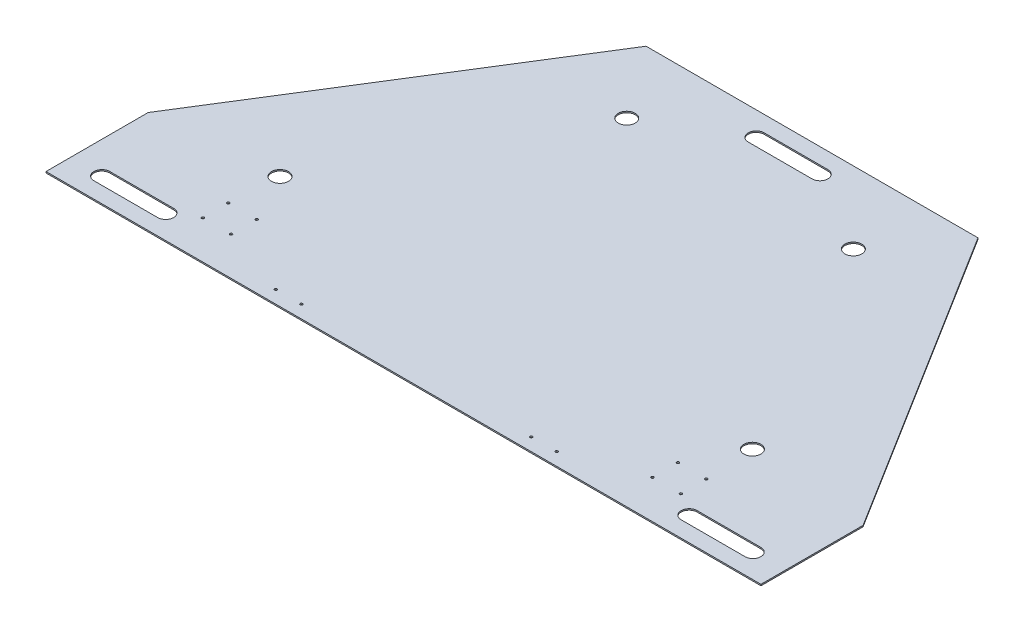
ISO-10303-21;
HEADER;
FILE_DESCRIPTION(('STEP AP214'),'2;1');
FILE_NAME('part.step','',(''),(''),'','','');
FILE_SCHEMA(('AUTOMOTIVE_DESIGN { 1 0 10303 214 1 1 1 1 }'));
ENDSEC;
DATA;
#1=APPLICATION_CONTEXT('core data for automotive mechanical design processes');
#2=APPLICATION_PROTOCOL_DEFINITION('international standard','automotive_design',2000,#1);
#3=PRODUCT_CONTEXT('',#1,'mechanical');
#4=PRODUCT('Part','Part','',(#3));
#5=PRODUCT_RELATED_PRODUCT_CATEGORY('part','',(#4));
#6=PRODUCT_DEFINITION_FORMATION('','',#4);
#7=PRODUCT_DEFINITION_CONTEXT('part definition',#1,'design');
#8=PRODUCT_DEFINITION('design','',#6,#7);
#9=PRODUCT_DEFINITION_SHAPE('','',#8);
#10=(LENGTH_UNIT() NAMED_UNIT(*) SI_UNIT(.MILLI.,.METRE.));
#11=(NAMED_UNIT(*) PLANE_ANGLE_UNIT() SI_UNIT($,.RADIAN.));
#12=(NAMED_UNIT(*) SI_UNIT($,.STERADIAN.) SOLID_ANGLE_UNIT());
#13=UNCERTAINTY_MEASURE_WITH_UNIT(LENGTH_MEASURE(1.E-05),#10,'distance_accuracy_value','');
#14=(GEOMETRIC_REPRESENTATION_CONTEXT(3) GLOBAL_UNCERTAINTY_ASSIGNED_CONTEXT((#13)) GLOBAL_UNIT_ASSIGNED_CONTEXT((#10,
#11,#12)) REPRESENTATION_CONTEXT('',''));
#15=CARTESIAN_POINT('',(0.,0.,0.));
#16=DIRECTION('',(0.,0.,1.));
#17=DIRECTION('',(1.,0.,0.));
#18=AXIS2_PLACEMENT_3D('',#15,#16,#17);
#19=CARTESIAN_POINT('',(0.,2.65684,0.));
#20=DIRECTION('',(0.,0.,-1.));
#21=DIRECTION('',(-1.,0.,0.));
#22=AXIS2_PLACEMENT_3D('',#19,#20,#21);
#23=PLANE('',#22);
#24=DIRECTION('',(1.,0.,0.));
#25=VECTOR('',#24,1.);
#26=CARTESIAN_POINT('',(0.,0.,0.));
#27=LINE('',#26,#25);
#28=CARTESIAN_POINT('',(-711.2,0.,0.));
#29=VERTEX_POINT('',#28);
#30=CARTESIAN_POINT('',(711.2,0.,0.));
#31=VERTEX_POINT('',#30);
#32=EDGE_CURVE('E198',#29,#31,#27,.T.);
#33=ORIENTED_EDGE('',*,*,#32,.T.);
#34=DIRECTION('',(0.,-1.,0.));
#35=VECTOR('',#34,1.);
#36=CARTESIAN_POINT('',(711.2,2.65684,0.));
#37=LINE('',#36,#35);
#38=CARTESIAN_POINT('',(711.2,2.65684,0.));
#39=VERTEX_POINT('',#38);
#40=EDGE_CURVE('E11',#39,#31,#37,.T.);
#41=ORIENTED_EDGE('',*,*,#40,.F.);
#42=DIRECTION('',(1.,0.,0.));
#43=VECTOR('',#42,1.);
#44=CARTESIAN_POINT('',(0.,2.65684,0.));
#45=LINE('',#44,#43);
#46=CARTESIAN_POINT('',(-711.2,2.65684,0.));
#47=VERTEX_POINT('',#46);
#48=EDGE_CURVE('E264',#47,#39,#45,.T.);
#49=ORIENTED_EDGE('',*,*,#48,.F.);
#50=DIRECTION('',(0.,-1.,0.));
#51=VECTOR('',#50,1.);
#52=CARTESIAN_POINT('',(-711.2,2.65684,0.));
#53=LINE('',#52,#51);
#54=EDGE_CURVE('E278',#47,#29,#53,.T.);
#55=ORIENTED_EDGE('',*,*,#54,.T.);
#56=EDGE_LOOP('',(#33,#41,#49,#55));
#57=FACE_BOUND('',#56,.T.);
#58=ADVANCED_FACE('F35',(#57),#23,.F.);
#59=CARTESIAN_POINT('',(711.2,2.65684,0.));
#60=DIRECTION('',(1.,0.,0.));
#61=DIRECTION('',(0.,0.,-1.));
#62=AXIS2_PLACEMENT_3D('',#59,#60,#61);
#63=PLANE('',#62);
#64=DIRECTION('',(0.,0.,1.));
#65=VECTOR('',#64,1.);
#66=CARTESIAN_POINT('',(711.2,0.,0.));
#67=LINE('',#66,#65);
#68=CARTESIAN_POINT('',(711.2,0.,-203.199999999999));
#69=VERTEX_POINT('',#68);
#70=EDGE_CURVE('E281',#69,#31,#67,.T.);
#71=ORIENTED_EDGE('',*,*,#70,.F.);
#72=DIRECTION('',(0.,-1.,0.));
#73=VECTOR('',#72,1.);
#74=CARTESIAN_POINT('',(711.2,2.65684,-203.199999999999));
#75=LINE('',#74,#73);
#76=CARTESIAN_POINT('',(711.2,2.65684,-203.199999999999));
#77=VERTEX_POINT('',#76);
#78=EDGE_CURVE('E42',#77,#69,#75,.T.);
#79=ORIENTED_EDGE('',*,*,#78,.F.);
#80=DIRECTION('',(0.,0.,1.));
#81=VECTOR('',#80,1.);
#82=CARTESIAN_POINT('',(711.2,2.65684,0.));
#83=LINE('',#82,#81);
#84=EDGE_CURVE('E266',#77,#39,#83,.T.);
#85=ORIENTED_EDGE('',*,*,#84,.T.);
#86=ORIENTED_EDGE('',*,*,#40,.T.);
#87=EDGE_LOOP('',(#71,#79,#85,#86));
#88=FACE_BOUND('',#87,.T.);
#89=ADVANCED_FACE('F313',(#88),#63,.T.);
#90=CARTESIAN_POINT('',(602.750561797753,2.65684,-376.719101123595));
#91=DIRECTION('',(-0.847998304005088,0.,0.52999894000318));
#92=DIRECTION('',(0.52999894000318,0.,0.847998304005088));
#93=AXIS2_PLACEMENT_3D('',#90,#91,#92);
#94=PLANE('',#93);
#95=DIRECTION('',(-0.52999894000318,0.,-0.847998304005088));
#96=VECTOR('',#95,1.);
#97=CARTESIAN_POINT('',(602.750561797753,0.,-376.719101123595));
#98=LINE('',#97,#96);
#99=CARTESIAN_POINT('',(330.2,0.,-812.8));
#100=VERTEX_POINT('',#99);
#101=EDGE_CURVE('E284',#69,#100,#98,.T.);
#102=ORIENTED_EDGE('',*,*,#101,.T.);
#103=DIRECTION('',(0.,-1.,0.));
#104=VECTOR('',#103,1.);
#105=CARTESIAN_POINT('',(330.2,2.65684,-812.8));
#106=LINE('',#105,#104);
#107=CARTESIAN_POINT('',(330.2,2.65684,-812.8));
#108=VERTEX_POINT('',#107);
#109=EDGE_CURVE('E299',#108,#100,#106,.T.);
#110=ORIENTED_EDGE('',*,*,#109,.F.);
#111=DIRECTION('',(-0.52999894000318,0.,-0.847998304005088));
#112=VECTOR('',#111,1.);
#113=CARTESIAN_POINT('',(602.750561797753,2.65684,-376.719101123595));
#114=LINE('',#113,#112);
#115=EDGE_CURVE('E270',#77,#108,#114,.T.);
#116=ORIENTED_EDGE('',*,*,#115,.F.);
#117=ORIENTED_EDGE('',*,*,#78,.T.);
#118=EDGE_LOOP('',(#102,#110,#116,#117));
#119=FACE_BOUND('',#118,.T.);
#120=ADVANCED_FACE('F304',(#119),#94,.F.);
#121=CARTESIAN_POINT('',(0.,2.65684,-812.8));
#122=DIRECTION('',(0.,0.,1.));
#123=DIRECTION('',(1.,0.,0.));
#124=AXIS2_PLACEMENT_3D('',#121,#122,#123);
#125=PLANE('',#124);
#126=DIRECTION('',(-1.,0.,0.));
#127=VECTOR('',#126,1.);
#128=CARTESIAN_POINT('',(0.,0.,-812.8));
#129=LINE('',#128,#127);
#130=CARTESIAN_POINT('',(-330.2,0.,-812.8));
#131=VERTEX_POINT('',#130);
#132=EDGE_CURVE('E286',#100,#131,#129,.T.);
#133=ORIENTED_EDGE('',*,*,#132,.T.);
#134=DIRECTION('',(0.,-1.,0.));
#135=VECTOR('',#134,1.);
#136=CARTESIAN_POINT('',(-330.2,2.65684,-812.8));
#137=LINE('',#136,#135);
#138=CARTESIAN_POINT('',(-330.2,2.65684,-812.8));
#139=VERTEX_POINT('',#138);
#140=EDGE_CURVE('E296',#139,#131,#137,.T.);
#141=ORIENTED_EDGE('',*,*,#140,.F.);
#142=DIRECTION('',(-1.,0.,0.));
#143=VECTOR('',#142,1.);
#144=CARTESIAN_POINT('',(0.,2.65684,-812.8));
#145=LINE('',#144,#143);
#146=EDGE_CURVE('E272',#108,#139,#145,.T.);
#147=ORIENTED_EDGE('',*,*,#146,.F.);
#148=ORIENTED_EDGE('',*,*,#109,.T.);
#149=EDGE_LOOP('',(#133,#141,#147,#148));
#150=FACE_BOUND('',#149,.T.);
#151=ADVANCED_FACE('F329',(#150),#125,.F.);
#152=CARTESIAN_POINT('',(-602.750561797753,2.65684,-376.719101123595));
#153=DIRECTION('',(0.847998304005088,0.,0.52999894000318));
#154=DIRECTION('',(0.52999894000318,0.,-0.847998304005088));
#155=AXIS2_PLACEMENT_3D('',#152,#153,#154);
#156=PLANE('',#155);
#157=DIRECTION('',(-0.52999894000318,0.,0.847998304005088));
#158=VECTOR('',#157,1.);
#159=CARTESIAN_POINT('',(-602.750561797753,0.,-376.719101123595));
#160=LINE('',#159,#158);
#161=CARTESIAN_POINT('',(-711.2,0.,-203.2));
#162=VERTEX_POINT('',#161);
#163=EDGE_CURVE('E288',#131,#162,#160,.T.);
#164=ORIENTED_EDGE('',*,*,#163,.T.);
#165=DIRECTION('',(0.,-1.,0.));
#166=VECTOR('',#165,1.);
#167=CARTESIAN_POINT('',(-711.2,2.65684,-203.2));
#168=LINE('',#167,#166);
#169=CARTESIAN_POINT('',(-711.2,2.65684,-203.2));
#170=VERTEX_POINT('',#169);
#171=EDGE_CURVE('E293',#170,#162,#168,.T.);
#172=ORIENTED_EDGE('',*,*,#171,.F.);
#173=DIRECTION('',(-0.52999894000318,0.,0.847998304005088));
#174=VECTOR('',#173,1.);
#175=CARTESIAN_POINT('',(-602.750561797753,2.65684,-376.719101123595));
#176=LINE('',#175,#174);
#177=EDGE_CURVE('E274',#139,#170,#176,.T.);
#178=ORIENTED_EDGE('',*,*,#177,.F.);
#179=ORIENTED_EDGE('',*,*,#140,.T.);
#180=EDGE_LOOP('',(#164,#172,#178,#179));
#181=FACE_BOUND('',#180,.T.);
#182=ADVANCED_FACE('F325',(#181),#156,.F.);
#183=CARTESIAN_POINT('',(-711.2,2.65684,0.));
#184=DIRECTION('',(1.,0.,0.));
#185=DIRECTION('',(0.,0.,-1.));
#186=AXIS2_PLACEMENT_3D('',#183,#184,#185);
#187=PLANE('',#186);
#188=DIRECTION('',(0.,0.,1.));
#189=VECTOR('',#188,1.);
#190=CARTESIAN_POINT('',(-711.2,0.,0.));
#191=LINE('',#190,#189);
#192=EDGE_CURVE('E267',#162,#29,#191,.T.);
#193=ORIENTED_EDGE('',*,*,#192,.T.);
#194=ORIENTED_EDGE('',*,*,#54,.F.);
#195=DIRECTION('',(0.,0.,1.));
#196=VECTOR('',#195,1.);
#197=CARTESIAN_POINT('',(-711.2,2.65684,0.));
#198=LINE('',#197,#196);
#199=EDGE_CURVE('E276',#170,#47,#198,.T.);
#200=ORIENTED_EDGE('',*,*,#199,.F.);
#201=ORIENTED_EDGE('',*,*,#171,.T.);
#202=EDGE_LOOP('',(#193,#194,#200,#201));
#203=FACE_BOUND('',#202,.T.);
#204=ADVANCED_FACE('F320',(#203),#187,.F.);
#205=CARTESIAN_POINT('',(0.,2.65684,0.));
#206=DIRECTION('',(0.,1.,0.));
#207=DIRECTION('',(0.,0.,1.));
#208=AXIS2_PLACEMENT_3D('',#205,#206,#207);
#209=PLANE('',#208);
#210=CARTESIAN_POINT('',(228.6,2.65684,-25.4));
#211=DIRECTION('',(0.,1.,0.));
#212=DIRECTION('',(0.,0.,1.));
#213=AXIS2_PLACEMENT_3D('',#210,#211,#212);
#214=CIRCLE('',#213,2.45745);
#215=CARTESIAN_POINT('',(228.6,2.65684,-22.94255));
#216=VERTEX_POINT('',#215);
#217=EDGE_CURVE('E658',#216,#216,#214,.T.);
#218=ORIENTED_EDGE('',*,*,#217,.F.);
#219=EDGE_LOOP('',(#218));
#220=FACE_BOUND('',#219,.T.);
#221=CARTESIAN_POINT('',(279.4,2.65684,-25.4));
#222=DIRECTION('',(0.,1.,0.));
#223=DIRECTION('',(0.,0.,1.));
#224=AXIS2_PLACEMENT_3D('',#221,#222,#223);
#225=CIRCLE('',#224,2.45744999999997);
#226=CARTESIAN_POINT('',(279.4,2.65684,-22.94255));
#227=VERTEX_POINT('',#226);
#228=EDGE_CURVE('E660',#227,#227,#225,.T.);
#229=ORIENTED_EDGE('',*,*,#228,.F.);
#230=EDGE_LOOP('',(#229));
#231=FACE_BOUND('',#230,.T.);
#232=CARTESIAN_POINT('',(419.1,2.65684,-76.1999999999999));
#233=DIRECTION('',(0.,1.,0.));
#234=DIRECTION('',(0.,0.,1.));
#235=AXIS2_PLACEMENT_3D('',#232,#233,#234);
#236=CIRCLE('',#235,2.45744999999997);
#237=CARTESIAN_POINT('',(419.1,2.65684,-73.74255));
#238=VERTEX_POINT('',#237);
#239=EDGE_CURVE('E668',#238,#238,#236,.T.);
#240=ORIENTED_EDGE('',*,*,#239,.F.);
#241=EDGE_LOOP('',(#240));
#242=FACE_BOUND('',#241,.T.);
#243=CARTESIAN_POINT('',(419.1,2.65684,-127.));
#244=DIRECTION('',(0.,1.,0.));
#245=DIRECTION('',(0.,0.,1.));
#246=AXIS2_PLACEMENT_3D('',#243,#244,#245);
#247=CIRCLE('',#246,2.45744999999997);
#248=CARTESIAN_POINT('',(419.1,2.65684,-124.54255));
#249=VERTEX_POINT('',#248);
#250=EDGE_CURVE('E674',#249,#249,#247,.T.);
#251=ORIENTED_EDGE('',*,*,#250,.F.);
#252=EDGE_LOOP('',(#251));
#253=FACE_BOUND('',#252,.T.);
#254=CARTESIAN_POINT('',(475.488,2.65684,-76.1999999999999));
#255=DIRECTION('',(0.,1.,0.));
#256=DIRECTION('',(0.,0.,1.));
#257=AXIS2_PLACEMENT_3D('',#254,#255,#256);
#258=CIRCLE('',#257,2.45744999999997);
#259=CARTESIAN_POINT('',(475.488,2.65684,-73.74255));
#260=VERTEX_POINT('',#259);
#261=EDGE_CURVE('E680',#260,#260,#258,.T.);
#262=ORIENTED_EDGE('',*,*,#261,.F.);
#263=EDGE_LOOP('',(#262));
#264=FACE_BOUND('',#263,.T.);
#265=CARTESIAN_POINT('',(475.488,2.65684,-127.));
#266=DIRECTION('',(0.,1.,0.));
#267=DIRECTION('',(0.,0.,1.));
#268=AXIS2_PLACEMENT_3D('',#265,#266,#267);
#269=CIRCLE('',#268,2.45744999999997);
#270=CARTESIAN_POINT('',(475.488,2.65684,-124.54255));
#271=VERTEX_POINT('',#270);
#272=EDGE_CURVE('E686',#271,#271,#269,.T.);
#273=ORIENTED_EDGE('',*,*,#272,.F.);
#274=EDGE_LOOP('',(#273));
#275=FACE_BOUND('',#274,.T.);
#276=CARTESIAN_POINT('',(-475.488,2.65684,-127.));
#277=DIRECTION('',(0.,1.,0.));
#278=DIRECTION('',(0.,0.,1.));
#279=AXIS2_PLACEMENT_3D('',#276,#277,#278);
#280=CIRCLE('',#279,2.45744999999997);
#281=CARTESIAN_POINT('',(-475.488,2.65684,-124.54255));
#282=VERTEX_POINT('',#281);
#283=EDGE_CURVE('E692',#282,#282,#280,.T.);
#284=ORIENTED_EDGE('',*,*,#283,.F.);
#285=EDGE_LOOP('',(#284));
#286=FACE_BOUND('',#285,.T.);
#287=CARTESIAN_POINT('',(-475.488,2.65684,-76.1999999999999));
#288=DIRECTION('',(0.,1.,0.));
#289=DIRECTION('',(0.,0.,1.));
#290=AXIS2_PLACEMENT_3D('',#287,#288,#289);
#291=CIRCLE('',#290,2.45744999999997);
#292=CARTESIAN_POINT('',(-475.488,2.65684,-73.7425499999999));
#293=VERTEX_POINT('',#292);
#294=EDGE_CURVE('E698',#293,#293,#291,.T.);
#295=ORIENTED_EDGE('',*,*,#294,.F.);
#296=EDGE_LOOP('',(#295));
#297=FACE_BOUND('',#296,.T.);
#298=CARTESIAN_POINT('',(-419.1,2.65684,-76.1999999999999));
#299=DIRECTION('',(0.,1.,0.));
#300=DIRECTION('',(0.,0.,1.));
#301=AXIS2_PLACEMENT_3D('',#298,#299,#300);
#302=CIRCLE('',#301,2.45744999999997);
#303=CARTESIAN_POINT('',(-419.1,2.65684,-73.7425499999999));
#304=VERTEX_POINT('',#303);
#305=EDGE_CURVE('E704',#304,#304,#302,.T.);
#306=ORIENTED_EDGE('',*,*,#305,.F.);
#307=EDGE_LOOP('',(#306));
#308=FACE_BOUND('',#307,.T.);
#309=CARTESIAN_POINT('',(-419.1,2.65684,-127.));
#310=DIRECTION('',(0.,1.,0.));
#311=DIRECTION('',(0.,0.,1.));
#312=AXIS2_PLACEMENT_3D('',#309,#310,#311);
#313=CIRCLE('',#312,2.45744999999997);
#314=CARTESIAN_POINT('',(-419.1,2.65684,-124.54255));
#315=VERTEX_POINT('',#314);
#316=EDGE_CURVE('E710',#315,#315,#313,.T.);
#317=ORIENTED_EDGE('',*,*,#316,.F.);
#318=EDGE_LOOP('',(#317));
#319=FACE_BOUND('',#318,.T.);
#320=CARTESIAN_POINT('',(-279.4,2.65684,-25.4));
#321=DIRECTION('',(0.,1.,0.));
#322=DIRECTION('',(0.,0.,1.));
#323=AXIS2_PLACEMENT_3D('',#320,#321,#322);
#324=CIRCLE('',#323,2.45744999999997);
#325=CARTESIAN_POINT('',(-279.4,2.65684,-22.94255));
#326=VERTEX_POINT('',#325);
#327=EDGE_CURVE('E716',#326,#326,#324,.T.);
#328=ORIENTED_EDGE('',*,*,#327,.F.);
#329=EDGE_LOOP('',(#328));
#330=FACE_BOUND('',#329,.T.);
#331=CARTESIAN_POINT('',(-228.6,2.65684,-25.4));
#332=DIRECTION('',(0.,1.,0.));
#333=DIRECTION('',(0.,0.,1.));
#334=AXIS2_PLACEMENT_3D('',#331,#332,#333);
#335=CIRCLE('',#334,2.45745);
#336=CARTESIAN_POINT('',(-228.6,2.65684,-22.94255));
#337=VERTEX_POINT('',#336);
#338=EDGE_CURVE('E722',#337,#337,#335,.T.);
#339=ORIENTED_EDGE('',*,*,#338,.F.);
#340=EDGE_LOOP('',(#339));
#341=FACE_BOUND('',#340,.T.);
#342=CARTESIAN_POINT('',(-469.9,2.65684,-224.282));
#343=DIRECTION('',(0.,1.,0.));
#344=DIRECTION('',(0.,0.,1.));
#345=AXIS2_PLACEMENT_3D('',#342,#343,#344);
#346=CIRCLE('',#345,16.891);
#347=CARTESIAN_POINT('',(-469.9,2.65684,-207.391));
#348=VERTEX_POINT('',#347);
#349=EDGE_CURVE('E730',#348,#348,#346,.T.);
#350=ORIENTED_EDGE('',*,*,#349,.F.);
#351=EDGE_LOOP('',(#350));
#352=FACE_BOUND('',#351,.T.);
#353=CARTESIAN_POINT('',(-225.425,2.65684,-669.586361504578));
#354=DIRECTION('',(0.,1.,0.));
#355=DIRECTION('',(0.,0.,1.));
#356=AXIS2_PLACEMENT_3D('',#353,#354,#355);
#357=CIRCLE('',#356,16.891);
#358=CARTESIAN_POINT('',(-225.425,2.65684,-652.695361504578));
#359=VERTEX_POINT('',#358);
#360=EDGE_CURVE('E736',#359,#359,#357,.T.);
#361=ORIENTED_EDGE('',*,*,#360,.F.);
#362=EDGE_LOOP('',(#361));
#363=FACE_BOUND('',#362,.T.);
#364=CARTESIAN_POINT('',(225.425,2.65684,-669.586361504578));
#365=DIRECTION('',(0.,1.,0.));
#366=DIRECTION('',(0.,0.,1.));
#367=AXIS2_PLACEMENT_3D('',#364,#365,#366);
#368=CIRCLE('',#367,16.891);
#369=CARTESIAN_POINT('',(225.425,2.65684,-652.695361504578));
#370=VERTEX_POINT('',#369);
#371=EDGE_CURVE('E742',#370,#370,#368,.T.);
#372=ORIENTED_EDGE('',*,*,#371,.F.);
#373=EDGE_LOOP('',(#372));
#374=FACE_BOUND('',#373,.T.);
#375=CARTESIAN_POINT('',(469.9,2.65684,-224.282));
#376=DIRECTION('',(0.,1.,0.));
#377=DIRECTION('',(0.,0.,1.));
#378=AXIS2_PLACEMENT_3D('',#375,#376,#377);
#379=CIRCLE('',#378,16.891);
#380=CARTESIAN_POINT('',(469.9,2.65684,-207.391));
#381=VERTEX_POINT('',#380);
#382=EDGE_CURVE('E185',#381,#381,#379,.T.);
#383=ORIENTED_EDGE('',*,*,#382,.F.);
#384=EDGE_LOOP('',(#383));
#385=FACE_BOUND('',#384,.T.);
#386=CARTESIAN_POINT('',(-63.5,2.65684,-765.175));
#387=DIRECTION('',(0.,1.,0.));
#388=DIRECTION('',(0.,0.,1.));
#389=AXIS2_PLACEMENT_3D('',#386,#387,#388);
#390=CIRCLE('',#389,15.875);
#391=CARTESIAN_POINT('',(-63.5,2.65684,-781.05));
#392=VERTEX_POINT('',#391);
#393=CARTESIAN_POINT('',(-63.4999999999998,2.65684,-749.3));
#394=VERTEX_POINT('',#393);
#395=EDGE_CURVE('E49',#392,#394,#390,.T.);
#396=ORIENTED_EDGE('',*,*,#395,.F.);
#397=DIRECTION('',(-1.,0.,0.));
#398=VECTOR('',#397,1.);
#399=CARTESIAN_POINT('',(-63.5,2.65684,-781.05));
#400=LINE('',#399,#398);
#401=CARTESIAN_POINT('',(63.5,2.65684,-781.05));
#402=VERTEX_POINT('',#401);
#403=EDGE_CURVE('E179',#402,#392,#400,.T.);
#404=ORIENTED_EDGE('',*,*,#403,.F.);
#405=CARTESIAN_POINT('',(63.5,2.65684,-765.175));
#406=DIRECTION('',(0.,1.,0.));
#407=DIRECTION('',(0.,0.,1.));
#408=AXIS2_PLACEMENT_3D('',#405,#406,#407);
#409=CIRCLE('',#408,15.875);
#410=CARTESIAN_POINT('',(63.4999999999998,2.65684,-749.3));
#411=VERTEX_POINT('',#410);
#412=EDGE_CURVE('E182',#411,#402,#409,.T.);
#413=ORIENTED_EDGE('',*,*,#412,.F.);
#414=DIRECTION('',(1.,0.,0.));
#415=VECTOR('',#414,1.);
#416=CARTESIAN_POINT('',(-63.4999999999998,2.65684,-749.3));
#417=LINE('',#416,#415);
#418=EDGE_CURVE('E191',#394,#411,#417,.T.);
#419=ORIENTED_EDGE('',*,*,#418,.F.);
#420=EDGE_LOOP('',(#396,#404,#413,#419));
#421=FACE_BOUND('',#420,.T.);
#422=CARTESIAN_POINT('',(-647.7,2.65684,-47.625));
#423=DIRECTION('',(0.,1.,0.));
#424=DIRECTION('',(0.,0.,1.));
#425=AXIS2_PLACEMENT_3D('',#422,#423,#424);
#426=CIRCLE('',#425,15.875);
#427=CARTESIAN_POINT('',(-647.7,2.65684,-63.5));
#428=VERTEX_POINT('',#427);
#429=CARTESIAN_POINT('',(-647.7,2.65684,-31.75));
#430=VERTEX_POINT('',#429);
#431=EDGE_CURVE('E57',#428,#430,#426,.T.);
#432=ORIENTED_EDGE('',*,*,#431,.F.);
#433=DIRECTION('',(-1.,0.,0.));
#434=VECTOR('',#433,1.);
#435=CARTESIAN_POINT('',(-647.7,2.65684,-63.5));
#436=LINE('',#435,#434);
#437=CARTESIAN_POINT('',(-520.7,2.65684,-63.5));
#438=VERTEX_POINT('',#437);
#439=EDGE_CURVE('E206',#438,#428,#436,.T.);
#440=ORIENTED_EDGE('',*,*,#439,.F.);
#441=CARTESIAN_POINT('',(-520.7,2.65684,-47.625));
#442=DIRECTION('',(0.,1.,0.));
#443=DIRECTION('',(0.,0.,1.));
#444=AXIS2_PLACEMENT_3D('',#441,#442,#443);
#445=CIRCLE('',#444,15.875);
#446=CARTESIAN_POINT('',(-520.7,2.65684,-31.75));
#447=VERTEX_POINT('',#446);
#448=EDGE_CURVE('E221',#447,#438,#445,.T.);
#449=ORIENTED_EDGE('',*,*,#448,.F.);
#450=DIRECTION('',(1.,0.,0.));
#451=VECTOR('',#450,1.);
#452=CARTESIAN_POINT('',(-647.7,2.65684,-31.75));
#453=LINE('',#452,#451);
#454=EDGE_CURVE('E217',#430,#447,#453,.T.);
#455=ORIENTED_EDGE('',*,*,#454,.F.);
#456=EDGE_LOOP('',(#432,#440,#449,#455));
#457=FACE_BOUND('',#456,.T.);
#458=CARTESIAN_POINT('',(520.7,2.65684,-47.625));
#459=DIRECTION('',(0.,1.,0.));
#460=DIRECTION('',(0.,0.,1.));
#461=AXIS2_PLACEMENT_3D('',#458,#459,#460);
#462=CIRCLE('',#461,15.875);
#463=CARTESIAN_POINT('',(520.7,2.65684,-63.5));
#464=VERTEX_POINT('',#463);
#465=CARTESIAN_POINT('',(520.7,2.65684,-31.75));
#466=VERTEX_POINT('',#465);
#467=EDGE_CURVE('E246',#464,#466,#462,.T.);
#468=ORIENTED_EDGE('',*,*,#467,.F.);
#469=DIRECTION('',(-1.,0.,0.));
#470=VECTOR('',#469,1.);
#471=CARTESIAN_POINT('',(520.7,2.65684,-63.5));
#472=LINE('',#471,#470);
#473=CARTESIAN_POINT('',(647.7,2.65684,-63.5));
#474=VERTEX_POINT('',#473);
#475=EDGE_CURVE('E236',#474,#464,#472,.T.);
#476=ORIENTED_EDGE('',*,*,#475,.F.);
#477=CARTESIAN_POINT('',(647.7,2.65684,-47.625));
#478=DIRECTION('',(0.,1.,0.));
#479=DIRECTION('',(0.,0.,1.));
#480=AXIS2_PLACEMENT_3D('',#477,#478,#479);
#481=CIRCLE('',#480,15.875);
#482=CARTESIAN_POINT('',(647.7,2.65684,-31.75));
#483=VERTEX_POINT('',#482);
#484=EDGE_CURVE('E252',#483,#474,#481,.T.);
#485=ORIENTED_EDGE('',*,*,#484,.F.);
#486=DIRECTION('',(1.,0.,0.));
#487=VECTOR('',#486,1.);
#488=CARTESIAN_POINT('',(520.7,2.65684,-31.75));
#489=LINE('',#488,#487);
#490=EDGE_CURVE('E248',#466,#483,#489,.T.);
#491=ORIENTED_EDGE('',*,*,#490,.F.);
#492=EDGE_LOOP('',(#468,#476,#485,#491));
#493=FACE_BOUND('',#492,.T.);
#494=ORIENTED_EDGE('',*,*,#48,.T.);
#495=ORIENTED_EDGE('',*,*,#84,.F.);
#496=ORIENTED_EDGE('',*,*,#115,.T.);
#497=ORIENTED_EDGE('',*,*,#146,.T.);
#498=ORIENTED_EDGE('',*,*,#177,.T.);
#499=ORIENTED_EDGE('',*,*,#199,.T.);
#500=EDGE_LOOP('',(#494,#495,#496,#497,#498,#499));
#501=FACE_BOUND('',#500,.T.);
#502=ADVANCED_FACE('F331',(#220,#231,#242,#253,#264,#275,#286,#297,#308,#319,#330,#341,#352,
#363,#374,#385,#421,#457,#493,#501),#209,.T.);
#503=CARTESIAN_POINT('',(0.,0.,0.));
#504=DIRECTION('',(0.,1.,0.));
#505=DIRECTION('',(0.,0.,1.));
#506=AXIS2_PLACEMENT_3D('',#503,#504,#505);
#507=PLANE('',#506);
#508=CARTESIAN_POINT('',(228.6,0.,-25.4));
#509=DIRECTION('',(0.,1.,0.));
#510=DIRECTION('',(0.,0.,1.));
#511=AXIS2_PLACEMENT_3D('',#508,#509,#510);
#512=CIRCLE('',#511,2.45745);
#513=CARTESIAN_POINT('',(228.6,0.,-22.94255));
#514=VERTEX_POINT('',#513);
#515=EDGE_CURVE('E656',#514,#514,#512,.T.);
#516=ORIENTED_EDGE('',*,*,#515,.T.);
#517=EDGE_LOOP('',(#516));
#518=FACE_BOUND('',#517,.T.);
#519=CARTESIAN_POINT('',(279.4,0.,-25.4));
#520=DIRECTION('',(0.,1.,0.));
#521=DIRECTION('',(0.,0.,1.));
#522=AXIS2_PLACEMENT_3D('',#519,#520,#521);
#523=CIRCLE('',#522,2.45744999999997);
#524=CARTESIAN_POINT('',(279.4,0.,-22.94255));
#525=VERTEX_POINT('',#524);
#526=EDGE_CURVE('E665',#525,#525,#523,.T.);
#527=ORIENTED_EDGE('',*,*,#526,.T.);
#528=EDGE_LOOP('',(#527));
#529=FACE_BOUND('',#528,.T.);
#530=CARTESIAN_POINT('',(419.1,0.,-76.1999999999999));
#531=DIRECTION('',(0.,1.,0.));
#532=DIRECTION('',(0.,0.,1.));
#533=AXIS2_PLACEMENT_3D('',#530,#531,#532);
#534=CIRCLE('',#533,2.45744999999997);
#535=CARTESIAN_POINT('',(419.1,0.,-73.74255));
#536=VERTEX_POINT('',#535);
#537=EDGE_CURVE('E671',#536,#536,#534,.T.);
#538=ORIENTED_EDGE('',*,*,#537,.T.);
#539=EDGE_LOOP('',(#538));
#540=FACE_BOUND('',#539,.T.);
#541=CARTESIAN_POINT('',(419.1,0.,-127.));
#542=DIRECTION('',(0.,1.,0.));
#543=DIRECTION('',(0.,0.,1.));
#544=AXIS2_PLACEMENT_3D('',#541,#542,#543);
#545=CIRCLE('',#544,2.45744999999997);
#546=CARTESIAN_POINT('',(419.1,0.,-124.54255));
#547=VERTEX_POINT('',#546);
#548=EDGE_CURVE('E677',#547,#547,#545,.T.);
#549=ORIENTED_EDGE('',*,*,#548,.T.);
#550=EDGE_LOOP('',(#549));
#551=FACE_BOUND('',#550,.T.);
#552=CARTESIAN_POINT('',(475.488,0.,-76.1999999999999));
#553=DIRECTION('',(0.,1.,0.));
#554=DIRECTION('',(0.,0.,1.));
#555=AXIS2_PLACEMENT_3D('',#552,#553,#554);
#556=CIRCLE('',#555,2.45744999999997);
#557=CARTESIAN_POINT('',(475.488,0.,-73.74255));
#558=VERTEX_POINT('',#557);
#559=EDGE_CURVE('E683',#558,#558,#556,.T.);
#560=ORIENTED_EDGE('',*,*,#559,.T.);
#561=EDGE_LOOP('',(#560));
#562=FACE_BOUND('',#561,.T.);
#563=CARTESIAN_POINT('',(475.488,0.,-127.));
#564=DIRECTION('',(0.,1.,0.));
#565=DIRECTION('',(0.,0.,1.));
#566=AXIS2_PLACEMENT_3D('',#563,#564,#565);
#567=CIRCLE('',#566,2.45744999999997);
#568=CARTESIAN_POINT('',(475.488,0.,-124.54255));
#569=VERTEX_POINT('',#568);
#570=EDGE_CURVE('E689',#569,#569,#567,.T.);
#571=ORIENTED_EDGE('',*,*,#570,.T.);
#572=EDGE_LOOP('',(#571));
#573=FACE_BOUND('',#572,.T.);
#574=CARTESIAN_POINT('',(-475.488,0.,-127.));
#575=DIRECTION('',(0.,1.,0.));
#576=DIRECTION('',(0.,0.,1.));
#577=AXIS2_PLACEMENT_3D('',#574,#575,#576);
#578=CIRCLE('',#577,2.45744999999997);
#579=CARTESIAN_POINT('',(-475.488,0.,-124.54255));
#580=VERTEX_POINT('',#579);
#581=EDGE_CURVE('E695',#580,#580,#578,.T.);
#582=ORIENTED_EDGE('',*,*,#581,.T.);
#583=EDGE_LOOP('',(#582));
#584=FACE_BOUND('',#583,.T.);
#585=CARTESIAN_POINT('',(-475.488,0.,-76.1999999999999));
#586=DIRECTION('',(0.,1.,0.));
#587=DIRECTION('',(0.,0.,1.));
#588=AXIS2_PLACEMENT_3D('',#585,#586,#587);
#589=CIRCLE('',#588,2.45744999999997);
#590=CARTESIAN_POINT('',(-475.488,0.,-73.7425499999999));
#591=VERTEX_POINT('',#590);
#592=EDGE_CURVE('E701',#591,#591,#589,.T.);
#593=ORIENTED_EDGE('',*,*,#592,.T.);
#594=EDGE_LOOP('',(#593));
#595=FACE_BOUND('',#594,.T.);
#596=CARTESIAN_POINT('',(-419.1,0.,-76.1999999999999));
#597=DIRECTION('',(0.,1.,0.));
#598=DIRECTION('',(0.,0.,1.));
#599=AXIS2_PLACEMENT_3D('',#596,#597,#598);
#600=CIRCLE('',#599,2.45744999999997);
#601=CARTESIAN_POINT('',(-419.1,0.,-73.7425499999999));
#602=VERTEX_POINT('',#601);
#603=EDGE_CURVE('E707',#602,#602,#600,.T.);
#604=ORIENTED_EDGE('',*,*,#603,.T.);
#605=EDGE_LOOP('',(#604));
#606=FACE_BOUND('',#605,.T.);
#607=CARTESIAN_POINT('',(-419.1,0.,-127.));
#608=DIRECTION('',(0.,1.,0.));
#609=DIRECTION('',(0.,0.,1.));
#610=AXIS2_PLACEMENT_3D('',#607,#608,#609);
#611=CIRCLE('',#610,2.45744999999997);
#612=CARTESIAN_POINT('',(-419.1,0.,-124.54255));
#613=VERTEX_POINT('',#612);
#614=EDGE_CURVE('E713',#613,#613,#611,.T.);
#615=ORIENTED_EDGE('',*,*,#614,.T.);
#616=EDGE_LOOP('',(#615));
#617=FACE_BOUND('',#616,.T.);
#618=CARTESIAN_POINT('',(-279.4,0.,-25.4));
#619=DIRECTION('',(0.,1.,0.));
#620=DIRECTION('',(0.,0.,1.));
#621=AXIS2_PLACEMENT_3D('',#618,#619,#620);
#622=CIRCLE('',#621,2.45744999999997);
#623=CARTESIAN_POINT('',(-279.4,0.,-22.94255));
#624=VERTEX_POINT('',#623);
#625=EDGE_CURVE('E719',#624,#624,#622,.T.);
#626=ORIENTED_EDGE('',*,*,#625,.T.);
#627=EDGE_LOOP('',(#626));
#628=FACE_BOUND('',#627,.T.);
#629=CARTESIAN_POINT('',(-228.6,0.,-25.4));
#630=DIRECTION('',(0.,1.,0.));
#631=DIRECTION('',(0.,0.,1.));
#632=AXIS2_PLACEMENT_3D('',#629,#630,#631);
#633=CIRCLE('',#632,2.45745);
#634=CARTESIAN_POINT('',(-228.6,0.,-22.94255));
#635=VERTEX_POINT('',#634);
#636=EDGE_CURVE('E725',#635,#635,#633,.T.);
#637=ORIENTED_EDGE('',*,*,#636,.T.);
#638=EDGE_LOOP('',(#637));
#639=FACE_BOUND('',#638,.T.);
#640=CARTESIAN_POINT('',(-469.9,0.,-224.282));
#641=DIRECTION('',(0.,1.,0.));
#642=DIRECTION('',(0.,0.,1.));
#643=AXIS2_PLACEMENT_3D('',#640,#641,#642);
#644=CIRCLE('',#643,16.891);
#645=CARTESIAN_POINT('',(-469.9,0.,-207.391));
#646=VERTEX_POINT('',#645);
#647=EDGE_CURVE('E249',#646,#646,#644,.T.);
#648=ORIENTED_EDGE('',*,*,#647,.T.);
#649=EDGE_LOOP('',(#648));
#650=FACE_BOUND('',#649,.T.);
#651=CARTESIAN_POINT('',(-225.425,0.,-669.586361504578));
#652=DIRECTION('',(0.,1.,0.));
#653=DIRECTION('',(0.,0.,1.));
#654=AXIS2_PLACEMENT_3D('',#651,#652,#653);
#655=CIRCLE('',#654,16.891);
#656=CARTESIAN_POINT('',(-225.425,0.,-652.695361504578));
#657=VERTEX_POINT('',#656);
#658=EDGE_CURVE('E733',#657,#657,#655,.T.);
#659=ORIENTED_EDGE('',*,*,#658,.T.);
#660=EDGE_LOOP('',(#659));
#661=FACE_BOUND('',#660,.T.);
#662=CARTESIAN_POINT('',(225.425,0.,-669.586361504578));
#663=DIRECTION('',(0.,1.,0.));
#664=DIRECTION('',(0.,0.,1.));
#665=AXIS2_PLACEMENT_3D('',#662,#663,#664);
#666=CIRCLE('',#665,16.891);
#667=CARTESIAN_POINT('',(225.425,0.,-652.695361504578));
#668=VERTEX_POINT('',#667);
#669=EDGE_CURVE('E739',#668,#668,#666,.T.);
#670=ORIENTED_EDGE('',*,*,#669,.T.);
#671=EDGE_LOOP('',(#670));
#672=FACE_BOUND('',#671,.T.);
#673=CARTESIAN_POINT('',(469.9,0.,-224.282));
#674=DIRECTION('',(0.,1.,0.));
#675=DIRECTION('',(0.,0.,1.));
#676=AXIS2_PLACEMENT_3D('',#673,#674,#675);
#677=CIRCLE('',#676,16.891);
#678=CARTESIAN_POINT('',(469.9,0.,-207.391));
#679=VERTEX_POINT('',#678);
#680=EDGE_CURVE('E744',#679,#679,#677,.T.);
#681=ORIENTED_EDGE('',*,*,#680,.T.);
#682=EDGE_LOOP('',(#681));
#683=FACE_BOUND('',#682,.T.);
#684=DIRECTION('',(-1.,0.,0.));
#685=VECTOR('',#684,1.);
#686=CARTESIAN_POINT('',(-63.5,0.,-781.05));
#687=LINE('',#686,#685);
#688=CARTESIAN_POINT('',(63.5,0.,-781.05));
#689=VERTEX_POINT('',#688);
#690=CARTESIAN_POINT('',(-63.5,0.,-781.05));
#691=VERTEX_POINT('',#690);
#692=EDGE_CURVE('E166',#689,#691,#687,.T.);
#693=ORIENTED_EDGE('',*,*,#692,.T.);
#694=CARTESIAN_POINT('',(-63.5,0.,-765.175));
#695=DIRECTION('',(0.,1.,0.));
#696=DIRECTION('',(0.,0.,1.));
#697=AXIS2_PLACEMENT_3D('',#694,#695,#696);
#698=CIRCLE('',#697,15.875);
#699=CARTESIAN_POINT('',(-63.4999999999998,0.,-749.3));
#700=VERTEX_POINT('',#699);
#701=EDGE_CURVE('E160',#691,#700,#698,.T.);
#702=ORIENTED_EDGE('',*,*,#701,.T.);
#703=DIRECTION('',(1.,0.,0.));
#704=VECTOR('',#703,1.);
#705=CARTESIAN_POINT('',(-63.4999999999998,0.,-749.3));
#706=LINE('',#705,#704);
#707=CARTESIAN_POINT('',(63.4999999999998,0.,-749.3));
#708=VERTEX_POINT('',#707);
#709=EDGE_CURVE('E170',#700,#708,#706,.T.);
#710=ORIENTED_EDGE('',*,*,#709,.T.);
#711=CARTESIAN_POINT('',(63.5,0.,-765.175));
#712=DIRECTION('',(0.,1.,0.));
#713=DIRECTION('',(0.,0.,1.));
#714=AXIS2_PLACEMENT_3D('',#711,#712,#713);
#715=CIRCLE('',#714,15.875);
#716=EDGE_CURVE('E174',#708,#689,#715,.T.);
#717=ORIENTED_EDGE('',*,*,#716,.T.);
#718=EDGE_LOOP('',(#693,#702,#710,#717));
#719=FACE_BOUND('',#718,.T.);
#720=DIRECTION('',(-1.,0.,0.));
#721=VECTOR('',#720,1.);
#722=CARTESIAN_POINT('',(-647.7,0.,-63.5));
#723=LINE('',#722,#721);
#724=CARTESIAN_POINT('',(-520.7,0.,-63.5));
#725=VERTEX_POINT('',#724);
#726=CARTESIAN_POINT('',(-647.7,0.,-63.5));
#727=VERTEX_POINT('',#726);
#728=EDGE_CURVE('E212',#725,#727,#723,.T.);
#729=ORIENTED_EDGE('',*,*,#728,.T.);
#730=CARTESIAN_POINT('',(-647.7,0.,-47.625));
#731=DIRECTION('',(0.,1.,0.));
#732=DIRECTION('',(0.,0.,1.));
#733=AXIS2_PLACEMENT_3D('',#730,#731,#732);
#734=CIRCLE('',#733,15.875);
#735=CARTESIAN_POINT('',(-647.7,0.,-31.75));
#736=VERTEX_POINT('',#735);
#737=EDGE_CURVE('E202',#727,#736,#734,.T.);
#738=ORIENTED_EDGE('',*,*,#737,.T.);
#739=DIRECTION('',(1.,0.,0.));
#740=VECTOR('',#739,1.);
#741=CARTESIAN_POINT('',(-647.7,0.,-31.75));
#742=LINE('',#741,#740);
#743=CARTESIAN_POINT('',(-520.7,0.,-31.75));
#744=VERTEX_POINT('',#743);
#745=EDGE_CURVE('E205',#736,#744,#742,.T.);
#746=ORIENTED_EDGE('',*,*,#745,.T.);
#747=CARTESIAN_POINT('',(-520.7,0.,-47.625));
#748=DIRECTION('',(0.,1.,0.));
#749=DIRECTION('',(0.,0.,1.));
#750=AXIS2_PLACEMENT_3D('',#747,#748,#749);
#751=CIRCLE('',#750,15.875);
#752=EDGE_CURVE('E209',#744,#725,#751,.T.);
#753=ORIENTED_EDGE('',*,*,#752,.T.);
#754=EDGE_LOOP('',(#729,#738,#746,#753));
#755=FACE_BOUND('',#754,.T.);
#756=DIRECTION('',(-1.,0.,0.));
#757=VECTOR('',#756,1.);
#758=CARTESIAN_POINT('',(520.7,0.,-63.5));
#759=LINE('',#758,#757);
#760=CARTESIAN_POINT('',(647.7,0.,-63.5));
#761=VERTEX_POINT('',#760);
#762=CARTESIAN_POINT('',(520.7,0.,-63.5));
#763=VERTEX_POINT('',#762);
#764=EDGE_CURVE('E242',#761,#763,#759,.T.);
#765=ORIENTED_EDGE('',*,*,#764,.T.);
#766=CARTESIAN_POINT('',(520.7,0.,-47.625));
#767=DIRECTION('',(0.,1.,0.));
#768=DIRECTION('',(0.,0.,1.));
#769=AXIS2_PLACEMENT_3D('',#766,#767,#768);
#770=CIRCLE('',#769,15.875);
#771=CARTESIAN_POINT('',(520.7,0.,-31.75));
#772=VERTEX_POINT('',#771);
#773=EDGE_CURVE('E232',#763,#772,#770,.T.);
#774=ORIENTED_EDGE('',*,*,#773,.T.);
#775=DIRECTION('',(1.,0.,0.));
#776=VECTOR('',#775,1.);
#777=CARTESIAN_POINT('',(520.7,0.,-31.75));
#778=LINE('',#777,#776);
#779=CARTESIAN_POINT('',(647.7,0.,-31.75));
#780=VERTEX_POINT('',#779);
#781=EDGE_CURVE('E235',#772,#780,#778,.T.);
#782=ORIENTED_EDGE('',*,*,#781,.T.);
#783=CARTESIAN_POINT('',(647.7,0.,-47.625));
#784=DIRECTION('',(0.,1.,0.));
#785=DIRECTION('',(0.,0.,1.));
#786=AXIS2_PLACEMENT_3D('',#783,#784,#785);
#787=CIRCLE('',#786,15.875);
#788=EDGE_CURVE('E239',#780,#761,#787,.T.);
#789=ORIENTED_EDGE('',*,*,#788,.T.);
#790=EDGE_LOOP('',(#765,#774,#782,#789));
#791=FACE_BOUND('',#790,.T.);
#792=ORIENTED_EDGE('',*,*,#32,.F.);
#793=ORIENTED_EDGE('',*,*,#192,.F.);
#794=ORIENTED_EDGE('',*,*,#163,.F.);
#795=ORIENTED_EDGE('',*,*,#132,.F.);
#796=ORIENTED_EDGE('',*,*,#101,.F.);
#797=ORIENTED_EDGE('',*,*,#70,.T.);
#798=EDGE_LOOP('',(#792,#793,#794,#795,#796,#797));
#799=FACE_BOUND('',#798,.T.);
#800=ADVANCED_FACE('F176',(#518,#529,#540,#551,#562,#573,#584,#595,#606,#617,#628,#639,#650,
#661,#672,#683,#719,#755,#791,#799),#507,.F.);
#801=CARTESIAN_POINT('',(520.7,0.,-47.625));
#802=DIRECTION('',(0.,1.,0.));
#803=DIRECTION('',(0.,0.,1.));
#804=AXIS2_PLACEMENT_3D('',#801,#802,#803);
#805=CYLINDRICAL_SURFACE('',#804,15.875);
#806=ORIENTED_EDGE('',*,*,#467,.T.);
#807=DIRECTION('',(0.,1.,0.));
#808=VECTOR('',#807,1.);
#809=CARTESIAN_POINT('',(520.7,0.,-31.75));
#810=LINE('',#809,#808);
#811=EDGE_CURVE('E245',#772,#466,#810,.T.);
#812=ORIENTED_EDGE('',*,*,#811,.F.);
#813=ORIENTED_EDGE('',*,*,#773,.F.);
#814=DIRECTION('',(0.,1.,0.));
#815=VECTOR('',#814,1.);
#816=CARTESIAN_POINT('',(520.7,0.,-63.5));
#817=LINE('',#816,#815);
#818=EDGE_CURVE('E218',#763,#464,#817,.T.);
#819=ORIENTED_EDGE('',*,*,#818,.T.);
#820=EDGE_LOOP('',(#806,#812,#813,#819));
#821=FACE_BOUND('',#820,.T.);
#822=ADVANCED_FACE('F339',(#821),#805,.F.);
#823=CARTESIAN_POINT('',(520.7,0.,-63.5));
#824=DIRECTION('',(0.,0.,-1.));
#825=DIRECTION('',(-1.,0.,0.));
#826=AXIS2_PLACEMENT_3D('',#823,#824,#825);
#827=PLANE('',#826);
#828=ORIENTED_EDGE('',*,*,#475,.T.);
#829=ORIENTED_EDGE('',*,*,#818,.F.);
#830=ORIENTED_EDGE('',*,*,#764,.F.);
#831=DIRECTION('',(0.,1.,0.));
#832=VECTOR('',#831,1.);
#833=CARTESIAN_POINT('',(647.7,0.,-63.5));
#834=LINE('',#833,#832);
#835=EDGE_CURVE('E258',#761,#474,#834,.T.);
#836=ORIENTED_EDGE('',*,*,#835,.T.);
#837=EDGE_LOOP('',(#828,#829,#830,#836));
#838=FACE_BOUND('',#837,.T.);
#839=ADVANCED_FACE('F387',(#838),#827,.F.);
#840=CARTESIAN_POINT('',(647.7,0.,-47.625));
#841=DIRECTION('',(0.,1.,0.));
#842=DIRECTION('',(0.,0.,1.));
#843=AXIS2_PLACEMENT_3D('',#840,#841,#842);
#844=CYLINDRICAL_SURFACE('',#843,15.875);
#845=ORIENTED_EDGE('',*,*,#484,.T.);
#846=ORIENTED_EDGE('',*,*,#835,.F.);
#847=ORIENTED_EDGE('',*,*,#788,.F.);
#848=DIRECTION('',(0.,1.,0.));
#849=VECTOR('',#848,1.);
#850=CARTESIAN_POINT('',(647.7,0.,-31.75));
#851=LINE('',#850,#849);
#852=EDGE_CURVE('E260',#780,#483,#851,.T.);
#853=ORIENTED_EDGE('',*,*,#852,.T.);
#854=EDGE_LOOP('',(#845,#846,#847,#853));
#855=FACE_BOUND('',#854,.T.);
#856=ADVANCED_FACE('F393',(#855),#844,.F.);
#857=CARTESIAN_POINT('',(520.7,0.,-31.75));
#858=DIRECTION('',(0.,0.,1.));
#859=DIRECTION('',(1.,0.,0.));
#860=AXIS2_PLACEMENT_3D('',#857,#858,#859);
#861=PLANE('',#860);
#862=ORIENTED_EDGE('',*,*,#490,.T.);
#863=ORIENTED_EDGE('',*,*,#852,.F.);
#864=ORIENTED_EDGE('',*,*,#781,.F.);
#865=ORIENTED_EDGE('',*,*,#811,.T.);
#866=EDGE_LOOP('',(#862,#863,#864,#865));
#867=FACE_BOUND('',#866,.T.);
#868=ADVANCED_FACE('F401',(#867),#861,.F.);
#869=CARTESIAN_POINT('',(-647.7,0.,-47.625));
#870=DIRECTION('',(0.,1.,0.));
#871=DIRECTION('',(0.,0.,1.));
#872=AXIS2_PLACEMENT_3D('',#869,#870,#871);
#873=CYLINDRICAL_SURFACE('',#872,15.875);
#874=ORIENTED_EDGE('',*,*,#431,.T.);
#875=DIRECTION('',(0.,1.,0.));
#876=VECTOR('',#875,1.);
#877=CARTESIAN_POINT('',(-647.7,0.,-31.75));
#878=LINE('',#877,#876);
#879=EDGE_CURVE('E215',#736,#430,#878,.T.);
#880=ORIENTED_EDGE('',*,*,#879,.F.);
#881=ORIENTED_EDGE('',*,*,#737,.F.);
#882=DIRECTION('',(0.,1.,0.));
#883=VECTOR('',#882,1.);
#884=CARTESIAN_POINT('',(-647.7,0.,-63.5));
#885=LINE('',#884,#883);
#886=EDGE_CURVE('E192',#727,#428,#885,.T.);
#887=ORIENTED_EDGE('',*,*,#886,.T.);
#888=EDGE_LOOP('',(#874,#880,#881,#887));
#889=FACE_BOUND('',#888,.T.);
#890=ADVANCED_FACE('F409',(#889),#873,.F.);
#891=CARTESIAN_POINT('',(-647.7,0.,-63.5));
#892=DIRECTION('',(0.,0.,-1.));
#893=DIRECTION('',(-1.,0.,0.));
#894=AXIS2_PLACEMENT_3D('',#891,#892,#893);
#895=PLANE('',#894);
#896=ORIENTED_EDGE('',*,*,#439,.T.);
#897=ORIENTED_EDGE('',*,*,#886,.F.);
#898=ORIENTED_EDGE('',*,*,#728,.F.);
#899=DIRECTION('',(0.,1.,0.));
#900=VECTOR('',#899,1.);
#901=CARTESIAN_POINT('',(-520.7,0.,-63.5));
#902=LINE('',#901,#900);
#903=EDGE_CURVE('E227',#725,#438,#902,.T.);
#904=ORIENTED_EDGE('',*,*,#903,.T.);
#905=EDGE_LOOP('',(#896,#897,#898,#904));
#906=FACE_BOUND('',#905,.T.);
#907=ADVANCED_FACE('F417',(#906),#895,.F.);
#908=CARTESIAN_POINT('',(-520.7,0.,-47.625));
#909=DIRECTION('',(0.,1.,0.));
#910=DIRECTION('',(0.,0.,1.));
#911=AXIS2_PLACEMENT_3D('',#908,#909,#910);
#912=CYLINDRICAL_SURFACE('',#911,15.875);
#913=ORIENTED_EDGE('',*,*,#448,.T.);
#914=ORIENTED_EDGE('',*,*,#903,.F.);
#915=ORIENTED_EDGE('',*,*,#752,.F.);
#916=DIRECTION('',(0.,1.,0.));
#917=VECTOR('',#916,1.);
#918=CARTESIAN_POINT('',(-520.7,0.,-31.75));
#919=LINE('',#918,#917);
#920=EDGE_CURVE('E229',#744,#447,#919,.T.);
#921=ORIENTED_EDGE('',*,*,#920,.T.);
#922=EDGE_LOOP('',(#913,#914,#915,#921));
#923=FACE_BOUND('',#922,.T.);
#924=ADVANCED_FACE('F424',(#923),#912,.F.);
#925=CARTESIAN_POINT('',(-647.7,0.,-31.75));
#926=DIRECTION('',(0.,0.,1.));
#927=DIRECTION('',(1.,0.,0.));
#928=AXIS2_PLACEMENT_3D('',#925,#926,#927);
#929=PLANE('',#928);
#930=ORIENTED_EDGE('',*,*,#454,.T.);
#931=ORIENTED_EDGE('',*,*,#920,.F.);
#932=ORIENTED_EDGE('',*,*,#745,.F.);
#933=ORIENTED_EDGE('',*,*,#879,.T.);
#934=EDGE_LOOP('',(#930,#931,#932,#933));
#935=FACE_BOUND('',#934,.T.);
#936=ADVANCED_FACE('F432',(#935),#929,.F.);
#937=CARTESIAN_POINT('',(-63.5,0.,-765.175));
#938=DIRECTION('',(0.,1.,0.));
#939=DIRECTION('',(0.,0.,1.));
#940=AXIS2_PLACEMENT_3D('',#937,#938,#939);
#941=CYLINDRICAL_SURFACE('',#940,15.875);
#942=ORIENTED_EDGE('',*,*,#395,.T.);
#943=DIRECTION('',(0.,1.,0.));
#944=VECTOR('',#943,1.);
#945=CARTESIAN_POINT('',(-63.4999999999998,0.,-749.3));
#946=LINE('',#945,#944);
#947=EDGE_CURVE('E156',#700,#394,#946,.T.);
#948=ORIENTED_EDGE('',*,*,#947,.F.);
#949=ORIENTED_EDGE('',*,*,#701,.F.);
#950=DIRECTION('',(0.,1.,0.));
#951=VECTOR('',#950,1.);
#952=CARTESIAN_POINT('',(-63.5,0.,-781.05));
#953=LINE('',#952,#951);
#954=EDGE_CURVE('E196',#691,#392,#953,.T.);
#955=ORIENTED_EDGE('',*,*,#954,.T.);
#956=EDGE_LOOP('',(#942,#948,#949,#955));
#957=FACE_BOUND('',#956,.T.);
#958=ADVANCED_FACE('F158',(#957),#941,.F.);
#959=CARTESIAN_POINT('',(-63.5,0.,-781.05));
#960=DIRECTION('',(0.,0.,-1.));
#961=DIRECTION('',(-1.,0.,0.));
#962=AXIS2_PLACEMENT_3D('',#959,#960,#961);
#963=PLANE('',#962);
#964=ORIENTED_EDGE('',*,*,#403,.T.);
#965=ORIENTED_EDGE('',*,*,#954,.F.);
#966=ORIENTED_EDGE('',*,*,#692,.F.);
#967=DIRECTION('',(0.,1.,0.));
#968=VECTOR('',#967,1.);
#969=CARTESIAN_POINT('',(63.5,0.,-781.05));
#970=LINE('',#969,#968);
#971=EDGE_CURVE('E199',#689,#402,#970,.T.);
#972=ORIENTED_EDGE('',*,*,#971,.T.);
#973=EDGE_LOOP('',(#964,#965,#966,#972));
#974=FACE_BOUND('',#973,.T.);
#975=ADVANCED_FACE('F447',(#974),#963,.F.);
#976=CARTESIAN_POINT('',(63.5,0.,-765.175));
#977=DIRECTION('',(0.,1.,0.));
#978=DIRECTION('',(0.,0.,1.));
#979=AXIS2_PLACEMENT_3D('',#976,#977,#978);
#980=CYLINDRICAL_SURFACE('',#979,15.875);
#981=ORIENTED_EDGE('',*,*,#412,.T.);
#982=ORIENTED_EDGE('',*,*,#971,.F.);
#983=ORIENTED_EDGE('',*,*,#716,.F.);
#984=DIRECTION('',(0.,1.,0.));
#985=VECTOR('',#984,1.);
#986=CARTESIAN_POINT('',(63.4999999999998,0.,-749.3));
#987=LINE('',#986,#985);
#988=EDGE_CURVE('E165',#708,#411,#987,.T.);
#989=ORIENTED_EDGE('',*,*,#988,.T.);
#990=EDGE_LOOP('',(#981,#982,#983,#989));
#991=FACE_BOUND('',#990,.T.);
#992=ADVANCED_FACE('F454',(#991),#980,.F.);
#993=CARTESIAN_POINT('',(-63.4999999999998,0.,-749.3));
#994=DIRECTION('',(0.,0.,1.));
#995=DIRECTION('',(1.,0.,0.));
#996=AXIS2_PLACEMENT_3D('',#993,#994,#995);
#997=PLANE('',#996);
#998=ORIENTED_EDGE('',*,*,#418,.T.);
#999=ORIENTED_EDGE('',*,*,#988,.F.);
#1000=ORIENTED_EDGE('',*,*,#709,.F.);
#1001=ORIENTED_EDGE('',*,*,#947,.T.);
#1002=EDGE_LOOP('',(#998,#999,#1000,#1001));
#1003=FACE_BOUND('',#1002,.T.);
#1004=ADVANCED_FACE('F171',(#1003),#997,.F.);
#1005=CARTESIAN_POINT('',(469.9,0.,-224.282));
#1006=DIRECTION('',(0.,1.,0.));
#1007=DIRECTION('',(0.,0.,1.));
#1008=AXIS2_PLACEMENT_3D('',#1005,#1006,#1007);
#1009=CYLINDRICAL_SURFACE('',#1008,16.891);
#1010=ORIENTED_EDGE('',*,*,#680,.F.);
#1011=EDGE_LOOP('',(#1010));
#1012=FACE_BOUND('',#1011,.T.);
#1013=ORIENTED_EDGE('',*,*,#382,.T.);
#1014=EDGE_LOOP('',(#1013));
#1015=FACE_BOUND('',#1014,.T.);
#1016=ADVANCED_FACE('F469',(#1012,#1015),#1009,.F.);
#1017=CARTESIAN_POINT('',(225.425,0.,-669.586361504578));
#1018=DIRECTION('',(0.,1.,0.));
#1019=DIRECTION('',(0.,0.,1.));
#1020=AXIS2_PLACEMENT_3D('',#1017,#1018,#1019);
#1021=CYLINDRICAL_SURFACE('',#1020,16.891);
#1022=ORIENTED_EDGE('',*,*,#669,.F.);
#1023=EDGE_LOOP('',(#1022));
#1024=FACE_BOUND('',#1023,.T.);
#1025=ORIENTED_EDGE('',*,*,#371,.T.);
#1026=EDGE_LOOP('',(#1025));
#1027=FACE_BOUND('',#1026,.T.);
#1028=ADVANCED_FACE('F476',(#1024,#1027),#1021,.F.);
#1029=CARTESIAN_POINT('',(-225.425,0.,-669.586361504578));
#1030=DIRECTION('',(0.,1.,0.));
#1031=DIRECTION('',(0.,0.,1.));
#1032=AXIS2_PLACEMENT_3D('',#1029,#1030,#1031);
#1033=CYLINDRICAL_SURFACE('',#1032,16.891);
#1034=ORIENTED_EDGE('',*,*,#658,.F.);
#1035=EDGE_LOOP('',(#1034));
#1036=FACE_BOUND('',#1035,.T.);
#1037=ORIENTED_EDGE('',*,*,#360,.T.);
#1038=EDGE_LOOP('',(#1037));
#1039=FACE_BOUND('',#1038,.T.);
#1040=ADVANCED_FACE('F484',(#1036,#1039),#1033,.F.);
#1041=CARTESIAN_POINT('',(-469.9,0.,-224.282));
#1042=DIRECTION('',(0.,1.,0.));
#1043=DIRECTION('',(0.,0.,1.));
#1044=AXIS2_PLACEMENT_3D('',#1041,#1042,#1043);
#1045=CYLINDRICAL_SURFACE('',#1044,16.891);
#1046=ORIENTED_EDGE('',*,*,#647,.F.);
#1047=EDGE_LOOP('',(#1046));
#1048=FACE_BOUND('',#1047,.T.);
#1049=ORIENTED_EDGE('',*,*,#349,.T.);
#1050=EDGE_LOOP('',(#1049));
#1051=FACE_BOUND('',#1050,.T.);
#1052=ADVANCED_FACE('F492',(#1048,#1051),#1045,.F.);
#1053=CARTESIAN_POINT('',(-228.6,2.65684,-25.4));
#1054=DIRECTION('',(0.,1.,0.));
#1055=DIRECTION('',(0.,0.,1.));
#1056=AXIS2_PLACEMENT_3D('',#1053,#1054,#1055);
#1057=CYLINDRICAL_SURFACE('',#1056,2.45745);
#1058=ORIENTED_EDGE('',*,*,#636,.F.);
#1059=EDGE_LOOP('',(#1058));
#1060=FACE_BOUND('',#1059,.T.);
#1061=ORIENTED_EDGE('',*,*,#338,.T.);
#1062=EDGE_LOOP('',(#1061));
#1063=FACE_BOUND('',#1062,.T.);
#1064=ADVANCED_FACE('F499',(#1060,#1063),#1057,.F.);
#1065=CARTESIAN_POINT('',(-279.4,2.65684,-25.4));
#1066=DIRECTION('',(0.,1.,0.));
#1067=DIRECTION('',(0.,0.,1.));
#1068=AXIS2_PLACEMENT_3D('',#1065,#1066,#1067);
#1069=CYLINDRICAL_SURFACE('',#1068,2.45744999999997);
#1070=ORIENTED_EDGE('',*,*,#625,.F.);
#1071=EDGE_LOOP('',(#1070));
#1072=FACE_BOUND('',#1071,.T.);
#1073=ORIENTED_EDGE('',*,*,#327,.T.);
#1074=EDGE_LOOP('',(#1073));
#1075=FACE_BOUND('',#1074,.T.);
#1076=ADVANCED_FACE('F506',(#1072,#1075),#1069,.F.);
#1077=CARTESIAN_POINT('',(-419.1,2.65684,-127.));
#1078=DIRECTION('',(0.,1.,0.));
#1079=DIRECTION('',(0.,0.,1.));
#1080=AXIS2_PLACEMENT_3D('',#1077,#1078,#1079);
#1081=CYLINDRICAL_SURFACE('',#1080,2.45744999999997);
#1082=ORIENTED_EDGE('',*,*,#614,.F.);
#1083=EDGE_LOOP('',(#1082));
#1084=FACE_BOUND('',#1083,.T.);
#1085=ORIENTED_EDGE('',*,*,#316,.T.);
#1086=EDGE_LOOP('',(#1085));
#1087=FACE_BOUND('',#1086,.T.);
#1088=ADVANCED_FACE('F514',(#1084,#1087),#1081,.F.);
#1089=CARTESIAN_POINT('',(-419.1,2.65684,-76.1999999999999));
#1090=DIRECTION('',(0.,1.,0.));
#1091=DIRECTION('',(0.,0.,1.));
#1092=AXIS2_PLACEMENT_3D('',#1089,#1090,#1091);
#1093=CYLINDRICAL_SURFACE('',#1092,2.45744999999997);
#1094=ORIENTED_EDGE('',*,*,#603,.F.);
#1095=EDGE_LOOP('',(#1094));
#1096=FACE_BOUND('',#1095,.T.);
#1097=ORIENTED_EDGE('',*,*,#305,.T.);
#1098=EDGE_LOOP('',(#1097));
#1099=FACE_BOUND('',#1098,.T.);
#1100=ADVANCED_FACE('F522',(#1096,#1099),#1093,.F.);
#1101=CARTESIAN_POINT('',(-475.488,2.65684,-76.1999999999999));
#1102=DIRECTION('',(0.,1.,0.));
#1103=DIRECTION('',(0.,0.,1.));
#1104=AXIS2_PLACEMENT_3D('',#1101,#1102,#1103);
#1105=CYLINDRICAL_SURFACE('',#1104,2.45744999999997);
#1106=ORIENTED_EDGE('',*,*,#592,.F.);
#1107=EDGE_LOOP('',(#1106));
#1108=FACE_BOUND('',#1107,.T.);
#1109=ORIENTED_EDGE('',*,*,#294,.T.);
#1110=EDGE_LOOP('',(#1109));
#1111=FACE_BOUND('',#1110,.T.);
#1112=ADVANCED_FACE('F530',(#1108,#1111),#1105,.F.);
#1113=CARTESIAN_POINT('',(-475.488,2.65684,-127.));
#1114=DIRECTION('',(0.,1.,0.));
#1115=DIRECTION('',(0.,0.,1.));
#1116=AXIS2_PLACEMENT_3D('',#1113,#1114,#1115);
#1117=CYLINDRICAL_SURFACE('',#1116,2.45744999999997);
#1118=ORIENTED_EDGE('',*,*,#581,.F.);
#1119=EDGE_LOOP('',(#1118));
#1120=FACE_BOUND('',#1119,.T.);
#1121=ORIENTED_EDGE('',*,*,#283,.T.);
#1122=EDGE_LOOP('',(#1121));
#1123=FACE_BOUND('',#1122,.T.);
#1124=ADVANCED_FACE('F538',(#1120,#1123),#1117,.F.);
#1125=CARTESIAN_POINT('',(475.488,2.65684,-127.));
#1126=DIRECTION('',(0.,1.,0.));
#1127=DIRECTION('',(0.,0.,1.));
#1128=AXIS2_PLACEMENT_3D('',#1125,#1126,#1127);
#1129=CYLINDRICAL_SURFACE('',#1128,2.45744999999997);
#1130=ORIENTED_EDGE('',*,*,#570,.F.);
#1131=EDGE_LOOP('',(#1130));
#1132=FACE_BOUND('',#1131,.T.);
#1133=ORIENTED_EDGE('',*,*,#272,.T.);
#1134=EDGE_LOOP('',(#1133));
#1135=FACE_BOUND('',#1134,.T.);
#1136=ADVANCED_FACE('F546',(#1132,#1135),#1129,.F.);
#1137=CARTESIAN_POINT('',(475.488,2.65684,-76.1999999999999));
#1138=DIRECTION('',(0.,1.,0.));
#1139=DIRECTION('',(0.,0.,1.));
#1140=AXIS2_PLACEMENT_3D('',#1137,#1138,#1139);
#1141=CYLINDRICAL_SURFACE('',#1140,2.45744999999997);
#1142=ORIENTED_EDGE('',*,*,#559,.F.);
#1143=EDGE_LOOP('',(#1142));
#1144=FACE_BOUND('',#1143,.T.);
#1145=ORIENTED_EDGE('',*,*,#261,.T.);
#1146=EDGE_LOOP('',(#1145));
#1147=FACE_BOUND('',#1146,.T.);
#1148=ADVANCED_FACE('F554',(#1144,#1147),#1141,.F.);
#1149=CARTESIAN_POINT('',(419.1,2.65684,-127.));
#1150=DIRECTION('',(0.,1.,0.));
#1151=DIRECTION('',(0.,0.,1.));
#1152=AXIS2_PLACEMENT_3D('',#1149,#1150,#1151);
#1153=CYLINDRICAL_SURFACE('',#1152,2.45744999999997);
#1154=ORIENTED_EDGE('',*,*,#548,.F.);
#1155=EDGE_LOOP('',(#1154));
#1156=FACE_BOUND('',#1155,.T.);
#1157=ORIENTED_EDGE('',*,*,#250,.T.);
#1158=EDGE_LOOP('',(#1157));
#1159=FACE_BOUND('',#1158,.T.);
#1160=ADVANCED_FACE('F562',(#1156,#1159),#1153,.F.);
#1161=CARTESIAN_POINT('',(419.1,2.65684,-76.1999999999999));
#1162=DIRECTION('',(0.,1.,0.));
#1163=DIRECTION('',(0.,0.,1.));
#1164=AXIS2_PLACEMENT_3D('',#1161,#1162,#1163);
#1165=CYLINDRICAL_SURFACE('',#1164,2.45744999999997);
#1166=ORIENTED_EDGE('',*,*,#537,.F.);
#1167=EDGE_LOOP('',(#1166));
#1168=FACE_BOUND('',#1167,.T.);
#1169=ORIENTED_EDGE('',*,*,#239,.T.);
#1170=EDGE_LOOP('',(#1169));
#1171=FACE_BOUND('',#1170,.T.);
#1172=ADVANCED_FACE('F570',(#1168,#1171),#1165,.F.);
#1173=CARTESIAN_POINT('',(279.4,2.65684,-25.4));
#1174=DIRECTION('',(0.,1.,0.));
#1175=DIRECTION('',(0.,0.,1.));
#1176=AXIS2_PLACEMENT_3D('',#1173,#1174,#1175);
#1177=CYLINDRICAL_SURFACE('',#1176,2.45744999999997);
#1178=ORIENTED_EDGE('',*,*,#526,.F.);
#1179=EDGE_LOOP('',(#1178));
#1180=FACE_BOUND('',#1179,.T.);
#1181=ORIENTED_EDGE('',*,*,#228,.T.);
#1182=EDGE_LOOP('',(#1181));
#1183=FACE_BOUND('',#1182,.T.);
#1184=ADVANCED_FACE('F578',(#1180,#1183),#1177,.F.);
#1185=CARTESIAN_POINT('',(228.6,2.65684,-25.4));
#1186=DIRECTION('',(0.,1.,0.));
#1187=DIRECTION('',(0.,0.,1.));
#1188=AXIS2_PLACEMENT_3D('',#1185,#1186,#1187);
#1189=CYLINDRICAL_SURFACE('',#1188,2.45745);
#1190=ORIENTED_EDGE('',*,*,#515,.F.);
#1191=EDGE_LOOP('',(#1190));
#1192=FACE_BOUND('',#1191,.T.);
#1193=ORIENTED_EDGE('',*,*,#217,.T.);
#1194=EDGE_LOOP('',(#1193));
#1195=FACE_BOUND('',#1194,.T.);
#1196=ADVANCED_FACE('F586',(#1192,#1195),#1189,.F.);
#1197=CLOSED_SHELL('',(#58,#89,#120,#151,#182,#204,#502,#800,#822,#839,#856,#868,#890,#907,#924,
#936,#958,#975,#992,#1004,#1016,#1028,#1040,#1052,#1064,#1076,#1088,#1100,#1112,#1124,#1136,
#1148,#1160,#1172,#1184,#1196));
#1198=MANIFOLD_SOLID_BREP('B2',#1197);
#1199=ADVANCED_BREP_SHAPE_REPRESENTATION('',(#18,#1198),#14);
#1200=SHAPE_DEFINITION_REPRESENTATION(#9,#1199);
ENDSEC;
END-ISO-10303-21;
